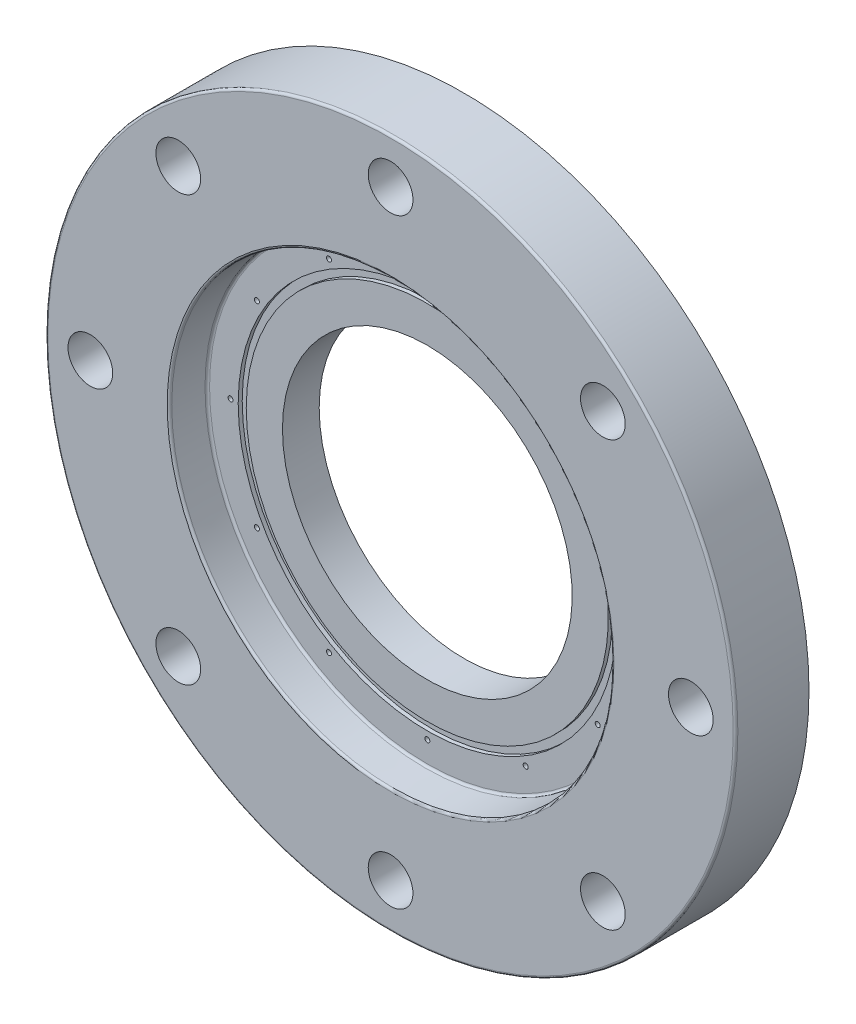
ISO-10303-21;
HEADER;
FILE_DESCRIPTION(('STEP AP214'),'2;1');
FILE_NAME('part.step','',(''),(''),'','','');
FILE_SCHEMA(('AUTOMOTIVE_DESIGN { 1 0 10303 214 1 1 1 1 }'));
ENDSEC;
DATA;
#1=APPLICATION_CONTEXT('core data for automotive mechanical design processes');
#2=APPLICATION_PROTOCOL_DEFINITION('international standard','automotive_design',2000,#1);
#3=PRODUCT_CONTEXT('',#1,'mechanical');
#4=PRODUCT('Part','Part','',(#3));
#5=PRODUCT_RELATED_PRODUCT_CATEGORY('part','',(#4));
#6=PRODUCT_DEFINITION_FORMATION('','',#4);
#7=PRODUCT_DEFINITION_CONTEXT('part definition',#1,'design');
#8=PRODUCT_DEFINITION('design','',#6,#7);
#9=PRODUCT_DEFINITION_SHAPE('','',#8);
#10=(LENGTH_UNIT() NAMED_UNIT(*) SI_UNIT(.MILLI.,.METRE.));
#11=(NAMED_UNIT(*) PLANE_ANGLE_UNIT() SI_UNIT($,.RADIAN.));
#12=(NAMED_UNIT(*) SI_UNIT($,.STERADIAN.) SOLID_ANGLE_UNIT());
#13=UNCERTAINTY_MEASURE_WITH_UNIT(LENGTH_MEASURE(1.E-05),#10,'distance_accuracy_value','');
#14=(GEOMETRIC_REPRESENTATION_CONTEXT(3) GLOBAL_UNCERTAINTY_ASSIGNED_CONTEXT((#13)) GLOBAL_UNIT_ASSIGNED_CONTEXT((#10,
#11,#12)) REPRESENTATION_CONTEXT('',''));
#15=CARTESIAN_POINT('',(0.,0.,0.));
#16=DIRECTION('',(0.,0.,1.));
#17=DIRECTION('',(1.,0.,0.));
#18=AXIS2_PLACEMENT_3D('',#15,#16,#17);
#19=CARTESIAN_POINT('',(0.,109.347,18.25625));
#20=DIRECTION('',(0.,0.,-1.));
#21=DIRECTION('',(0.,1.,0.));
#22=AXIS2_PLACEMENT_3D('',#19,#20,#21);
#23=PLANE('',#22);
#24=CARTESIAN_POINT('',(0.,0.,18.25625));
#25=DIRECTION('',(0.,0.,-1.));
#26=DIRECTION('',(0.,1.,0.));
#27=AXIS2_PLACEMENT_3D('',#24,#25,#26);
#28=CIRCLE('',#27,72.);
#29=CARTESIAN_POINT('',(0.,72.,18.25625));
#30=VERTEX_POINT('',#29);
#31=EDGE_CURVE('E44',#30,#30,#28,.T.);
#32=ORIENTED_EDGE('',*,*,#31,.T.);
#33=EDGE_LOOP('',(#32));
#34=FACE_BOUND('',#33,.T.);
#35=CARTESIAN_POINT('',(0.,0.,18.25625));
#36=DIRECTION('',(0.,0.,-1.));
#37=DIRECTION('',(-1.,0.,0.));
#38=AXIS2_PLACEMENT_3D('',#35,#36,#37);
#39=CIRCLE('',#38,90.);
#40=CARTESIAN_POINT('',(-90.,0.,18.25625));
#41=VERTEX_POINT('',#40);
#42=EDGE_CURVE('E837',#41,#41,#39,.T.);
#43=ORIENTED_EDGE('',*,*,#42,.F.);
#44=EDGE_LOOP('',(#43));
#45=FACE_BOUND('',#44,.T.);
#46=ADVANCED_FACE('F40',(#34,#45),#23,.F.);
#47=CARTESIAN_POINT('',(0.,0.,36.5125));
#48=DIRECTION('',(0.,0.,-1.));
#49=DIRECTION('',(-1.,0.,0.));
#50=AXIS2_PLACEMENT_3D('',#47,#48,#49);
#51=CYLINDRICAL_SURFACE('',#50,171.45);
#52=CARTESIAN_POINT('',(0.,0.,35.3579545454545));
#53=DIRECTION('',(0.,0.,1.));
#54=DIRECTION('',(1.,0.,0.));
#55=AXIS2_PLACEMENT_3D('',#52,#53,#54);
#56=CIRCLE('',#55,171.45);
#57=CARTESIAN_POINT('',(171.45,0.,35.3579545454545));
#58=VERTEX_POINT('',#57);
#59=EDGE_CURVE('E11',#58,#58,#56,.F.);
#60=ORIENTED_EDGE('',*,*,#59,.T.);
#61=EDGE_LOOP('',(#60));
#62=FACE_BOUND('',#61,.T.);
#63=CARTESIAN_POINT('',(0.,0.,0.));
#64=DIRECTION('',(0.,0.,1.));
#65=DIRECTION('',(1.,0.,0.));
#66=AXIS2_PLACEMENT_3D('',#63,#64,#65);
#67=CIRCLE('',#66,171.45);
#68=CARTESIAN_POINT('',(171.45,0.,0.));
#69=VERTEX_POINT('',#68);
#70=EDGE_CURVE('E218',#69,#69,#67,.T.);
#71=ORIENTED_EDGE('',*,*,#70,.T.);
#72=EDGE_LOOP('',(#71));
#73=FACE_BOUND('',#72,.T.);
#74=ADVANCED_FACE('F256',(#62,#73),#51,.T.);
#75=CARTESIAN_POINT('',(0.,0.,36.5125));
#76=DIRECTION('',(0.,0.,1.));
#77=DIRECTION('',(1.,0.,0.));
#78=AXIS2_PLACEMENT_3D('',#75,#76,#77);
#79=PLANE('',#78);
#80=CARTESIAN_POINT('',(0.,0.,36.5125));
#81=DIRECTION('',(0.,0.,1.));
#82=DIRECTION('',(1.,0.,0.));
#83=AXIS2_PLACEMENT_3D('',#80,#81,#82);
#84=CIRCLE('',#83,111.037468728978);
#85=CARTESIAN_POINT('',(111.037468728978,0.,36.5125));
#86=VERTEX_POINT('',#85);
#87=EDGE_CURVE('E49',#86,#86,#84,.F.);
#88=ORIENTED_EDGE('',*,*,#87,.T.);
#89=EDGE_LOOP('',(#88));
#90=FACE_BOUND('',#89,.T.);
#91=CARTESIAN_POINT('',(0.,0.,36.5125));
#92=DIRECTION('',(0.,0.,1.));
#93=DIRECTION('',(1.,0.,0.));
#94=AXIS2_PLACEMENT_3D('',#91,#92,#93);
#95=CIRCLE('',#94,170.295454545455);
#96=CARTESIAN_POINT('',(170.295454545455,0.,36.5125));
#97=VERTEX_POINT('',#96);
#98=EDGE_CURVE('E232',#97,#97,#95,.T.);
#99=ORIENTED_EDGE('',*,*,#98,.T.);
#100=EDGE_LOOP('',(#99));
#101=FACE_BOUND('',#100,.T.);
#102=CARTESIAN_POINT('',(105.518009422561,105.518009422564,36.5125));
#103=DIRECTION('',(0.,0.,1.));
#104=DIRECTION('',(0.707106781186556,-0.707106781186539,0.));
#105=AXIS2_PLACEMENT_3D('',#102,#103,#104);
#106=CIRCLE('',#105,11.1125);
#107=CARTESIAN_POINT('',(113.375733528497,97.6602853166284,36.5125));
#108=VERTEX_POINT('',#107);
#109=EDGE_CURVE('E176',#108,#108,#106,.T.);
#110=ORIENTED_EDGE('',*,*,#109,.F.);
#111=EDGE_LOOP('',(#110));
#112=FACE_BOUND('',#111,.T.);
#113=CARTESIAN_POINT('',(149.225,1.5630489083666E-12,36.5125));
#114=DIRECTION('',(0.,0.,1.));
#115=DIRECTION('',(0.,-1.,0.));
#116=AXIS2_PLACEMENT_3D('',#113,#114,#115);
#117=CIRCLE('',#116,11.1125);
#118=CARTESIAN_POINT('',(149.225,-11.1124999999984,36.5125));
#119=VERTEX_POINT('',#118);
#120=EDGE_CURVE('E175',#119,#119,#117,.T.);
#121=ORIENTED_EDGE('',*,*,#120,.F.);
#122=EDGE_LOOP('',(#121));
#123=FACE_BOUND('',#122,.T.);
#124=CARTESIAN_POINT('',(105.518009422563,-105.518009422562,36.5125));
#125=DIRECTION('',(0.,0.,1.));
#126=DIRECTION('',(-0.707106781186541,-0.707106781186554,0.));
#127=AXIS2_PLACEMENT_3D('',#124,#125,#126);
#128=CIRCLE('',#127,11.1125);
#129=CARTESIAN_POINT('',(97.660285316628,-113.375733528497,36.5125));
#130=VERTEX_POINT('',#129);
#131=EDGE_CURVE('E182',#130,#130,#128,.T.);
#132=ORIENTED_EDGE('',*,*,#131,.F.);
#133=EDGE_LOOP('',(#132));
#134=FACE_BOUND('',#133,.T.);
#135=CARTESIAN_POINT('',(1.04203260557773E-12,-149.225,36.5125));
#136=DIRECTION('',(0.,0.,1.));
#137=DIRECTION('',(-1.,0.,0.));
#138=AXIS2_PLACEMENT_3D('',#135,#136,#137);
#139=CIRCLE('',#138,11.1125);
#140=CARTESIAN_POINT('',(-11.112499999999,-149.225,36.5125));
#141=VERTEX_POINT('',#140);
#142=EDGE_CURVE('E188',#141,#141,#139,.T.);
#143=ORIENTED_EDGE('',*,*,#142,.F.);
#144=EDGE_LOOP('',(#143));
#145=FACE_BOUND('',#144,.T.);
#146=CARTESIAN_POINT('',(-105.518009422562,-105.518009422563,36.5125));
#147=DIRECTION('',(0.,0.,1.));
#148=DIRECTION('',(-0.707106781186551,0.707106781186544,0.));
#149=AXIS2_PLACEMENT_3D('',#146,#147,#148);
#150=CIRCLE('',#149,11.1125);
#151=CARTESIAN_POINT('',(-113.375733528498,-97.6602853166276,36.5125));
#152=VERTEX_POINT('',#151);
#153=EDGE_CURVE('E194',#152,#152,#150,.T.);
#154=ORIENTED_EDGE('',*,*,#153,.F.);
#155=EDGE_LOOP('',(#154));
#156=FACE_BOUND('',#155,.T.);
#157=CARTESIAN_POINT('',(-149.225,-5.21016302788867E-13,36.5125));
#158=DIRECTION('',(0.,0.,1.));
#159=DIRECTION('',(0.,1.,0.));
#160=AXIS2_PLACEMENT_3D('',#157,#158,#159);
#161=CIRCLE('',#160,11.1125);
#162=CARTESIAN_POINT('',(-149.225,11.1124999999995,36.5125));
#163=VERTEX_POINT('',#162);
#164=EDGE_CURVE('E200',#163,#163,#161,.T.);
#165=ORIENTED_EDGE('',*,*,#164,.F.);
#166=EDGE_LOOP('',(#165));
#167=FACE_BOUND('',#166,.T.);
#168=CARTESIAN_POINT('',(-105.518009422563,105.518009422562,36.5125));
#169=DIRECTION('',(0.,0.,1.));
#170=DIRECTION('',(0.707106781186546,0.707106781186549,0.));
#171=AXIS2_PLACEMENT_3D('',#168,#169,#170);
#172=CIRCLE('',#171,11.1125);
#173=CARTESIAN_POINT('',(-97.6602853166273,113.375733528498,36.5125));
#174=VERTEX_POINT('',#173);
#175=EDGE_CURVE('E206',#174,#174,#172,.T.);
#176=ORIENTED_EDGE('',*,*,#175,.F.);
#177=EDGE_LOOP('',(#176));
#178=FACE_BOUND('',#177,.T.);
#179=CARTESIAN_POINT('',(0.,149.225,36.5125));
#180=DIRECTION('',(0.,0.,1.));
#181=DIRECTION('',(1.,0.,0.));
#182=AXIS2_PLACEMENT_3D('',#179,#180,#181);
#183=CIRCLE('',#182,11.1125);
#184=CARTESIAN_POINT('',(11.1125,149.225,36.5125));
#185=VERTEX_POINT('',#184);
#186=EDGE_CURVE('E212',#185,#185,#183,.T.);
#187=ORIENTED_EDGE('',*,*,#186,.F.);
#188=EDGE_LOOP('',(#187));
#189=FACE_BOUND('',#188,.T.);
#190=ADVANCED_FACE('F238',(#90,#101,#112,#123,#134,#145,#156,#167,#178,#189),#79,.T.);
#191=CARTESIAN_POINT('',(0.,0.,0.));
#192=DIRECTION('',(0.,0.,1.));
#193=DIRECTION('',(1.,0.,0.));
#194=AXIS2_PLACEMENT_3D('',#191,#192,#193);
#195=PLANE('',#194);
#196=CARTESIAN_POINT('',(0.,0.,0.));
#197=DIRECTION('',(0.,0.,-1.));
#198=DIRECTION('',(-1.,0.,0.));
#199=AXIS2_PLACEMENT_3D('',#196,#197,#198);
#200=CIRCLE('',#199,72.);
#201=CARTESIAN_POINT('',(-72.,0.,0.));
#202=VERTEX_POINT('',#201);
#203=EDGE_CURVE('E169',#202,#202,#200,.T.);
#204=ORIENTED_EDGE('',*,*,#203,.F.);
#205=EDGE_LOOP('',(#204));
#206=FACE_BOUND('',#205,.T.);
#207=CARTESIAN_POINT('',(105.518009422561,105.518009422564,0.));
#208=DIRECTION('',(0.,0.,1.));
#209=DIRECTION('',(0.707106781186556,-0.707106781186539,0.));
#210=AXIS2_PLACEMENT_3D('',#207,#208,#209);
#211=CIRCLE('',#210,11.1125);
#212=CARTESIAN_POINT('',(113.375733528497,97.6602853166284,0.));
#213=VERTEX_POINT('',#212);
#214=EDGE_CURVE('E172',#213,#213,#211,.T.);
#215=ORIENTED_EDGE('',*,*,#214,.T.);
#216=EDGE_LOOP('',(#215));
#217=FACE_BOUND('',#216,.T.);
#218=CARTESIAN_POINT('',(149.225,1.5630489083666E-12,0.));
#219=DIRECTION('',(0.,0.,1.));
#220=DIRECTION('',(0.,-1.,0.));
#221=AXIS2_PLACEMENT_3D('',#218,#219,#220);
#222=CIRCLE('',#221,11.1125);
#223=CARTESIAN_POINT('',(149.225,-11.1124999999984,0.));
#224=VERTEX_POINT('',#223);
#225=EDGE_CURVE('E179',#224,#224,#222,.T.);
#226=ORIENTED_EDGE('',*,*,#225,.T.);
#227=EDGE_LOOP('',(#226));
#228=FACE_BOUND('',#227,.T.);
#229=CARTESIAN_POINT('',(105.518009422563,-105.518009422562,0.));
#230=DIRECTION('',(0.,0.,1.));
#231=DIRECTION('',(-0.707106781186541,-0.707106781186554,0.));
#232=AXIS2_PLACEMENT_3D('',#229,#230,#231);
#233=CIRCLE('',#232,11.1125);
#234=CARTESIAN_POINT('',(97.660285316628,-113.375733528497,0.));
#235=VERTEX_POINT('',#234);
#236=EDGE_CURVE('E185',#235,#235,#233,.T.);
#237=ORIENTED_EDGE('',*,*,#236,.T.);
#238=EDGE_LOOP('',(#237));
#239=FACE_BOUND('',#238,.T.);
#240=CARTESIAN_POINT('',(1.04203260557773E-12,-149.225,0.));
#241=DIRECTION('',(0.,0.,1.));
#242=DIRECTION('',(-1.,0.,0.));
#243=AXIS2_PLACEMENT_3D('',#240,#241,#242);
#244=CIRCLE('',#243,11.1125);
#245=CARTESIAN_POINT('',(-11.112499999999,-149.225,0.));
#246=VERTEX_POINT('',#245);
#247=EDGE_CURVE('E191',#246,#246,#244,.T.);
#248=ORIENTED_EDGE('',*,*,#247,.T.);
#249=EDGE_LOOP('',(#248));
#250=FACE_BOUND('',#249,.T.);
#251=CARTESIAN_POINT('',(-105.518009422562,-105.518009422563,0.));
#252=DIRECTION('',(0.,0.,1.));
#253=DIRECTION('',(-0.707106781186551,0.707106781186544,0.));
#254=AXIS2_PLACEMENT_3D('',#251,#252,#253);
#255=CIRCLE('',#254,11.1125);
#256=CARTESIAN_POINT('',(-113.375733528498,-97.6602853166276,0.));
#257=VERTEX_POINT('',#256);
#258=EDGE_CURVE('E197',#257,#257,#255,.T.);
#259=ORIENTED_EDGE('',*,*,#258,.T.);
#260=EDGE_LOOP('',(#259));
#261=FACE_BOUND('',#260,.T.);
#262=CARTESIAN_POINT('',(-149.225,-5.21016302788867E-13,0.));
#263=DIRECTION('',(0.,0.,1.));
#264=DIRECTION('',(0.,1.,0.));
#265=AXIS2_PLACEMENT_3D('',#262,#263,#264);
#266=CIRCLE('',#265,11.1125);
#267=CARTESIAN_POINT('',(-149.225,11.1124999999995,0.));
#268=VERTEX_POINT('',#267);
#269=EDGE_CURVE('E203',#268,#268,#266,.T.);
#270=ORIENTED_EDGE('',*,*,#269,.T.);
#271=EDGE_LOOP('',(#270));
#272=FACE_BOUND('',#271,.T.);
#273=CARTESIAN_POINT('',(-105.518009422563,105.518009422562,0.));
#274=DIRECTION('',(0.,0.,1.));
#275=DIRECTION('',(0.707106781186546,0.707106781186549,0.));
#276=AXIS2_PLACEMENT_3D('',#273,#274,#275);
#277=CIRCLE('',#276,11.1125);
#278=CARTESIAN_POINT('',(-97.6602853166273,113.375733528498,0.));
#279=VERTEX_POINT('',#278);
#280=EDGE_CURVE('E209',#279,#279,#277,.T.);
#281=ORIENTED_EDGE('',*,*,#280,.T.);
#282=EDGE_LOOP('',(#281));
#283=FACE_BOUND('',#282,.T.);
#284=CARTESIAN_POINT('',(0.,149.225,0.));
#285=DIRECTION('',(0.,0.,1.));
#286=DIRECTION('',(1.,0.,0.));
#287=AXIS2_PLACEMENT_3D('',#284,#285,#286);
#288=CIRCLE('',#287,11.1125);
#289=CARTESIAN_POINT('',(11.1125,149.225,0.));
#290=VERTEX_POINT('',#289);
#291=EDGE_CURVE('E215',#290,#290,#288,.T.);
#292=ORIENTED_EDGE('',*,*,#291,.T.);
#293=EDGE_LOOP('',(#292));
#294=FACE_BOUND('',#293,.T.);
#295=ORIENTED_EDGE('',*,*,#70,.F.);
#296=EDGE_LOOP('',(#295));
#297=FACE_BOUND('',#296,.T.);
#298=ADVANCED_FACE('F336',(#206,#217,#228,#239,#250,#261,#272,#283,#294,#297),#195,.F.);
#299=CARTESIAN_POINT('',(0.,149.225,0.));
#300=DIRECTION('',(0.,0.,1.));
#301=DIRECTION('',(1.,0.,0.));
#302=AXIS2_PLACEMENT_3D('',#299,#300,#301);
#303=CYLINDRICAL_SURFACE('',#302,11.1125);
#304=ORIENTED_EDGE('',*,*,#291,.F.);
#305=EDGE_LOOP('',(#304));
#306=FACE_BOUND('',#305,.T.);
#307=ORIENTED_EDGE('',*,*,#186,.T.);
#308=EDGE_LOOP('',(#307));
#309=FACE_BOUND('',#308,.T.);
#310=ADVANCED_FACE('F339',(#306,#309),#303,.F.);
#311=CARTESIAN_POINT('',(-105.518009422563,105.518009422562,0.));
#312=DIRECTION('',(0.,0.,1.));
#313=DIRECTION('',(1.,0.,0.));
#314=AXIS2_PLACEMENT_3D('',#311,#312,#313);
#315=CYLINDRICAL_SURFACE('',#314,11.1125);
#316=ORIENTED_EDGE('',*,*,#280,.F.);
#317=EDGE_LOOP('',(#316));
#318=FACE_BOUND('',#317,.T.);
#319=ORIENTED_EDGE('',*,*,#175,.T.);
#320=EDGE_LOOP('',(#319));
#321=FACE_BOUND('',#320,.T.);
#322=ADVANCED_FACE('F362',(#318,#321),#315,.F.);
#323=CARTESIAN_POINT('',(-149.225,-5.21016302788867E-13,0.));
#324=DIRECTION('',(0.,0.,1.));
#325=DIRECTION('',(1.,0.,0.));
#326=AXIS2_PLACEMENT_3D('',#323,#324,#325);
#327=CYLINDRICAL_SURFACE('',#326,11.1125);
#328=ORIENTED_EDGE('',*,*,#269,.F.);
#329=EDGE_LOOP('',(#328));
#330=FACE_BOUND('',#329,.T.);
#331=ORIENTED_EDGE('',*,*,#164,.T.);
#332=EDGE_LOOP('',(#331));
#333=FACE_BOUND('',#332,.T.);
#334=ADVANCED_FACE('F373',(#330,#333),#327,.F.);
#335=CARTESIAN_POINT('',(-105.518009422562,-105.518009422563,0.));
#336=DIRECTION('',(0.,0.,1.));
#337=DIRECTION('',(1.,0.,0.));
#338=AXIS2_PLACEMENT_3D('',#335,#336,#337);
#339=CYLINDRICAL_SURFACE('',#338,11.1125);
#340=ORIENTED_EDGE('',*,*,#258,.F.);
#341=EDGE_LOOP('',(#340));
#342=FACE_BOUND('',#341,.T.);
#343=ORIENTED_EDGE('',*,*,#153,.T.);
#344=EDGE_LOOP('',(#343));
#345=FACE_BOUND('',#344,.T.);
#346=ADVANCED_FACE('F377',(#342,#345),#339,.F.);
#347=CARTESIAN_POINT('',(1.04203260557773E-12,-149.225,0.));
#348=DIRECTION('',(0.,0.,1.));
#349=DIRECTION('',(1.,0.,0.));
#350=AXIS2_PLACEMENT_3D('',#347,#348,#349);
#351=CYLINDRICAL_SURFACE('',#350,11.1125);
#352=ORIENTED_EDGE('',*,*,#247,.F.);
#353=EDGE_LOOP('',(#352));
#354=FACE_BOUND('',#353,.T.);
#355=ORIENTED_EDGE('',*,*,#142,.T.);
#356=EDGE_LOOP('',(#355));
#357=FACE_BOUND('',#356,.T.);
#358=ADVANCED_FACE('F381',(#354,#357),#351,.F.);
#359=CARTESIAN_POINT('',(105.518009422563,-105.518009422562,0.));
#360=DIRECTION('',(0.,0.,1.));
#361=DIRECTION('',(1.,0.,0.));
#362=AXIS2_PLACEMENT_3D('',#359,#360,#361);
#363=CYLINDRICAL_SURFACE('',#362,11.1125);
#364=ORIENTED_EDGE('',*,*,#236,.F.);
#365=EDGE_LOOP('',(#364));
#366=FACE_BOUND('',#365,.T.);
#367=ORIENTED_EDGE('',*,*,#131,.T.);
#368=EDGE_LOOP('',(#367));
#369=FACE_BOUND('',#368,.T.);
#370=ADVANCED_FACE('F385',(#366,#369),#363,.F.);
#371=CARTESIAN_POINT('',(149.225,1.5630489083666E-12,0.));
#372=DIRECTION('',(0.,0.,1.));
#373=DIRECTION('',(1.,0.,0.));
#374=AXIS2_PLACEMENT_3D('',#371,#372,#373);
#375=CYLINDRICAL_SURFACE('',#374,11.1125);
#376=ORIENTED_EDGE('',*,*,#225,.F.);
#377=EDGE_LOOP('',(#376));
#378=FACE_BOUND('',#377,.T.);
#379=ORIENTED_EDGE('',*,*,#120,.T.);
#380=EDGE_LOOP('',(#379));
#381=FACE_BOUND('',#380,.T.);
#382=ADVANCED_FACE('F277',(#378,#381),#375,.F.);
#383=CARTESIAN_POINT('',(105.518009422561,105.518009422564,0.));
#384=DIRECTION('',(0.,0.,1.));
#385=DIRECTION('',(1.,0.,0.));
#386=AXIS2_PLACEMENT_3D('',#383,#384,#385);
#387=CYLINDRICAL_SURFACE('',#386,11.1125);
#388=ORIENTED_EDGE('',*,*,#214,.F.);
#389=EDGE_LOOP('',(#388));
#390=FACE_BOUND('',#389,.T.);
#391=ORIENTED_EDGE('',*,*,#109,.T.);
#392=EDGE_LOOP('',(#391));
#393=FACE_BOUND('',#392,.T.);
#394=ADVANCED_FACE('F270',(#390,#393),#387,.F.);
#395=CARTESIAN_POINT('',(0.,0.,18.25625));
#396=DIRECTION('',(0.,0.,-1.));
#397=DIRECTION('',(-1.,0.,0.));
#398=AXIS2_PLACEMENT_3D('',#395,#396,#397);
#399=CIRCLE('',#398,94.);
#400=CARTESIAN_POINT('',(-94.,0.,18.25625));
#401=VERTEX_POINT('',#400);
#402=EDGE_CURVE('E282',#401,#401,#399,.T.);
#403=ORIENTED_EDGE('',*,*,#402,.T.);
#404=EDGE_LOOP('',(#403));
#405=FACE_BOUND('',#404,.T.);
#406=CARTESIAN_POINT('',(-48.8950000000067,84.6886242360764,18.25625));
#407=DIRECTION('',(0.,0.,1.));
#408=DIRECTION('',(1.,0.,0.));
#409=AXIS2_PLACEMENT_3D('',#406,#407,#408);
#410=CIRCLE('',#409,1.24999999999999);
#411=CARTESIAN_POINT('',(-47.6450000000067,84.6886242360764,18.25625));
#412=VERTEX_POINT('',#411);
#413=EDGE_CURVE('E97',#412,#412,#410,.T.);
#414=ORIENTED_EDGE('',*,*,#413,.F.);
#415=EDGE_LOOP('',(#414));
#416=FACE_BOUND('',#415,.T.);
#417=CARTESIAN_POINT('',(-84.6886242360838,48.8949999999939,18.25625));
#418=DIRECTION('',(0.,0.,1.));
#419=DIRECTION('',(1.,0.,0.));
#420=AXIS2_PLACEMENT_3D('',#417,#418,#419);
#421=CIRCLE('',#420,1.24999999999999);
#422=CARTESIAN_POINT('',(-83.4386242360838,48.8949999999939,18.25625));
#423=VERTEX_POINT('',#422);
#424=EDGE_CURVE('E96',#423,#423,#421,.T.);
#425=ORIENTED_EDGE('',*,*,#424,.F.);
#426=EDGE_LOOP('',(#425));
#427=FACE_BOUND('',#426,.T.);
#428=CARTESIAN_POINT('',(-97.79,-6.27152140327151E-12,18.25625));
#429=DIRECTION('',(0.,0.,1.));
#430=DIRECTION('',(1.,0.,0.));
#431=AXIS2_PLACEMENT_3D('',#428,#429,#430);
#432=CIRCLE('',#431,1.24999999999999);
#433=CARTESIAN_POINT('',(-96.54,-6.27152140327151E-12,18.25625));
#434=VERTEX_POINT('',#433);
#435=EDGE_CURVE('E109',#434,#434,#432,.T.);
#436=ORIENTED_EDGE('',*,*,#435,.F.);
#437=EDGE_LOOP('',(#436));
#438=FACE_BOUND('',#437,.T.);
#439=CARTESIAN_POINT('',(-84.6886242360775,-48.8950000000049,18.25625));
#440=DIRECTION('',(0.,0.,1.));
#441=DIRECTION('',(1.,0.,0.));
#442=AXIS2_PLACEMENT_3D('',#439,#440,#441);
#443=CIRCLE('',#442,1.24999999999999);
#444=CARTESIAN_POINT('',(-83.4386242360775,-48.8950000000049,18.25625));
#445=VERTEX_POINT('',#444);
#446=EDGE_CURVE('E115',#445,#445,#443,.T.);
#447=ORIENTED_EDGE('',*,*,#446,.F.);
#448=EDGE_LOOP('',(#447));
#449=FACE_BOUND('',#448,.T.);
#450=CARTESIAN_POINT('',(-48.8949999999958,-84.6886242360827,18.25625));
#451=DIRECTION('',(0.,0.,1.));
#452=DIRECTION('',(1.,0.,0.));
#453=AXIS2_PLACEMENT_3D('',#450,#451,#452);
#454=CIRCLE('',#453,1.24999999999999);
#455=CARTESIAN_POINT('',(-47.6449999999958,-84.6886242360827,18.25625));
#456=VERTEX_POINT('',#455);
#457=EDGE_CURVE('E121',#456,#456,#454,.T.);
#458=ORIENTED_EDGE('',*,*,#457,.F.);
#459=EDGE_LOOP('',(#458));
#460=FACE_BOUND('',#459,.T.);
#461=CARTESIAN_POINT('',(4.18101426884767E-12,-97.79,18.25625));
#462=DIRECTION('',(0.,0.,1.));
#463=DIRECTION('',(1.,0.,0.));
#464=AXIS2_PLACEMENT_3D('',#461,#462,#463);
#465=CIRCLE('',#464,1.24999999999999);
#466=CARTESIAN_POINT('',(1.25000000000417,-97.79,18.25625));
#467=VERTEX_POINT('',#466);
#468=EDGE_CURVE('E127',#467,#467,#465,.T.);
#469=ORIENTED_EDGE('',*,*,#468,.F.);
#470=EDGE_LOOP('',(#469));
#471=FACE_BOUND('',#470,.T.);
#472=CARTESIAN_POINT('',(48.895000000003,-84.6886242360785,18.25625));
#473=DIRECTION('',(0.,0.,1.));
#474=DIRECTION('',(1.,0.,0.));
#475=AXIS2_PLACEMENT_3D('',#472,#473,#474);
#476=CIRCLE('',#475,1.24999999999999);
#477=CARTESIAN_POINT('',(50.145000000003,-84.6886242360785,18.25625));
#478=VERTEX_POINT('',#477);
#479=EDGE_CURVE('E133',#478,#478,#476,.T.);
#480=ORIENTED_EDGE('',*,*,#479,.F.);
#481=EDGE_LOOP('',(#480));
#482=FACE_BOUND('',#481,.T.);
#483=CARTESIAN_POINT('',(84.6886242360817,-48.8949999999976,18.25625));
#484=DIRECTION('',(0.,0.,1.));
#485=DIRECTION('',(1.,0.,0.));
#486=AXIS2_PLACEMENT_3D('',#483,#484,#485);
#487=CIRCLE('',#486,1.24999999999999);
#488=CARTESIAN_POINT('',(85.9386242360817,-48.8949999999976,18.25625));
#489=VERTEX_POINT('',#488);
#490=EDGE_CURVE('E139',#489,#489,#487,.T.);
#491=ORIENTED_EDGE('',*,*,#490,.F.);
#492=EDGE_LOOP('',(#491));
#493=FACE_BOUND('',#492,.T.);
#494=CARTESIAN_POINT('',(97.79,2.09050713442384E-12,18.25625));
#495=DIRECTION('',(0.,0.,1.));
#496=DIRECTION('',(1.,0.,0.));
#497=AXIS2_PLACEMENT_3D('',#494,#495,#496);
#498=CIRCLE('',#497,1.24999999999999);
#499=CARTESIAN_POINT('',(99.04,2.09050713442384E-12,18.25625));
#500=VERTEX_POINT('',#499);
#501=EDGE_CURVE('E145',#500,#500,#498,.T.);
#502=ORIENTED_EDGE('',*,*,#501,.F.);
#503=EDGE_LOOP('',(#502));
#504=FACE_BOUND('',#503,.T.);
#505=CARTESIAN_POINT('',(84.6886242360796,48.8950000000012,18.25625));
#506=DIRECTION('',(0.,0.,1.));
#507=DIRECTION('',(1.,0.,0.));
#508=AXIS2_PLACEMENT_3D('',#505,#506,#507);
#509=CIRCLE('',#508,1.24999999999999);
#510=CARTESIAN_POINT('',(85.9386242360795,48.8950000000012,18.25625));
#511=VERTEX_POINT('',#510);
#512=EDGE_CURVE('E151',#511,#511,#509,.T.);
#513=ORIENTED_EDGE('',*,*,#512,.F.);
#514=EDGE_LOOP('',(#513));
#515=FACE_BOUND('',#514,.T.);
#516=CARTESIAN_POINT('',(48.8949999999994,84.6886242360806,18.25625));
#517=DIRECTION('',(0.,0.,1.));
#518=DIRECTION('',(1.,0.,0.));
#519=AXIS2_PLACEMENT_3D('',#516,#517,#518);
#520=CIRCLE('',#519,1.24999999999999);
#521=CARTESIAN_POINT('',(50.1449999999994,84.6886242360806,18.25625));
#522=VERTEX_POINT('',#521);
#523=EDGE_CURVE('E157',#522,#522,#520,.T.);
#524=ORIENTED_EDGE('',*,*,#523,.F.);
#525=EDGE_LOOP('',(#524));
#526=FACE_BOUND('',#525,.T.);
#527=CARTESIAN_POINT('',(0.,97.79,18.25625));
#528=DIRECTION('',(0.,0.,1.));
#529=DIRECTION('',(1.,0.,0.));
#530=AXIS2_PLACEMENT_3D('',#527,#528,#529);
#531=CIRCLE('',#530,1.24999999999999);
#532=CARTESIAN_POINT('',(1.24999999999999,97.79,18.25625));
#533=VERTEX_POINT('',#532);
#534=EDGE_CURVE('E163',#533,#533,#531,.T.);
#535=ORIENTED_EDGE('',*,*,#534,.F.);
#536=EDGE_LOOP('',(#535));
#537=FACE_BOUND('',#536,.T.);
#538=CARTESIAN_POINT('',(0.,0.,18.25625));
#539=DIRECTION('',(0.,0.,-1.));
#540=DIRECTION('',(0.,1.,0.));
#541=AXIS2_PLACEMENT_3D('',#538,#539,#540);
#542=CIRCLE('',#541,108.228031271022);
#543=CARTESIAN_POINT('',(0.,108.228031271022,18.25625));
#544=VERTEX_POINT('',#543);
#545=EDGE_CURVE('E229',#544,#544,#542,.F.);
#546=ORIENTED_EDGE('',*,*,#545,.T.);
#547=EDGE_LOOP('',(#546));
#548=FACE_BOUND('',#547,.T.);
#549=ADVANCED_FACE('F259',(#405,#416,#427,#438,#449,#460,#471,#482,#493,#504,#515,#526,#537,
#548),#23,.F.);
#550=CARTESIAN_POINT('',(0.,0.,18.25625));
#551=DIRECTION('',(0.,0.,1.));
#552=DIRECTION('',(0.,-1.,0.));
#553=AXIS2_PLACEMENT_3D('',#550,#551,#552);
#554=CONICAL_SURFACE('',#553,109.347,0.0312941281419109);
#555=CARTESIAN_POINT('',(0.,0.,19.3746708580904));
#556=DIRECTION('',(0.,0.,1.));
#557=DIRECTION('',(0.,-1.,0.));
#558=AXIS2_PLACEMENT_3D('',#555,#556,#557);
#559=CIRCLE('',#558,109.382011435558);
#560=CARTESIAN_POINT('',(0.,-109.382011435558,19.3746708580904));
#561=VERTEX_POINT('',#560);
#562=EDGE_CURVE('E226',#561,#561,#559,.F.);
#563=ORIENTED_EDGE('',*,*,#562,.T.);
#564=EDGE_LOOP('',(#563));
#565=FACE_BOUND('',#564,.T.);
#566=CARTESIAN_POINT('',(0.,0.,35.3940791419096));
#567=DIRECTION('',(0.,0.,1.));
#568=DIRECTION('',(0.,-1.,0.));
#569=AXIS2_PLACEMENT_3D('',#566,#567,#568);
#570=CIRCLE('',#569,109.883488564442);
#571=CARTESIAN_POINT('',(0.,-109.883488564442,35.3940791419096));
#572=VERTEX_POINT('',#571);
#573=EDGE_CURVE('E223',#572,#572,#570,.T.);
#574=ORIENTED_EDGE('',*,*,#573,.T.);
#575=EDGE_LOOP('',(#574));
#576=FACE_BOUND('',#575,.T.);
#577=ADVANCED_FACE('F251',(#565,#576),#554,.F.);
#578=CARTESIAN_POINT('',(0.,0.,19.4107954545455));
#579=DIRECTION('',(0.,0.,-1.));
#580=DIRECTION('',(0.,1.,0.));
#581=AXIS2_PLACEMENT_3D('',#578,#579,#580);
#582=TOROIDAL_SURFACE('',#581,108.228031271022,1.15454545454545);
#583=ORIENTED_EDGE('',*,*,#545,.F.);
#584=EDGE_LOOP('',(#583));
#585=FACE_BOUND('',#584,.T.);
#586=ORIENTED_EDGE('',*,*,#562,.F.);
#587=EDGE_LOOP('',(#586));
#588=FACE_BOUND('',#587,.T.);
#589=ADVANCED_FACE('F243',(#585,#588),#582,.F.);
#590=CARTESIAN_POINT('',(0.,0.,35.3579545454545));
#591=DIRECTION('',(0.,0.,1.));
#592=DIRECTION('',(1.,0.,0.));
#593=AXIS2_PLACEMENT_3D('',#590,#591,#592);
#594=TOROIDAL_SURFACE('',#593,111.037468728978,1.15454545454545);
#595=ORIENTED_EDGE('',*,*,#573,.F.);
#596=EDGE_LOOP('',(#595));
#597=FACE_BOUND('',#596,.T.);
#598=ORIENTED_EDGE('',*,*,#87,.F.);
#599=EDGE_LOOP('',(#598));
#600=FACE_BOUND('',#599,.T.);
#601=ADVANCED_FACE('F241',(#597,#600),#594,.T.);
#602=CARTESIAN_POINT('',(0.,0.,35.3579545454545));
#603=DIRECTION('',(0.,0.,1.));
#604=DIRECTION('',(1.,0.,0.));
#605=AXIS2_PLACEMENT_3D('',#602,#603,#604);
#606=TOROIDAL_SURFACE('',#605,170.295454545455,1.15454545454545);
#607=ORIENTED_EDGE('',*,*,#59,.F.);
#608=EDGE_LOOP('',(#607));
#609=FACE_BOUND('',#608,.T.);
#610=ORIENTED_EDGE('',*,*,#98,.F.);
#611=EDGE_LOOP('',(#610));
#612=FACE_BOUND('',#611,.T.);
#613=ADVANCED_FACE('F42',(#609,#612),#606,.T.);
#614=CARTESIAN_POINT('',(0.,0.,120.));
#615=DIRECTION('',(0.,0.,-1.));
#616=DIRECTION('',(-1.,0.,0.));
#617=AXIS2_PLACEMENT_3D('',#614,#615,#616);
#618=CYLINDRICAL_SURFACE('',#617,72.);
#619=ORIENTED_EDGE('',*,*,#203,.T.);
#620=EDGE_LOOP('',(#619));
#621=FACE_BOUND('',#620,.T.);
#622=ORIENTED_EDGE('',*,*,#31,.F.);
#623=EDGE_LOOP('',(#622));
#624=FACE_BOUND('',#623,.T.);
#625=ADVANCED_FACE('F249',(#621,#624),#618,.F.);
#626=CARTESIAN_POINT('',(0.,97.79,6.25625));
#627=DIRECTION('',(0.,0.,1.));
#628=DIRECTION('',(1.,0.,0.));
#629=AXIS2_PLACEMENT_3D('',#626,#627,#628);
#630=CONICAL_SURFACE('',#629,1.25,1.02974425867665);
#631=CARTESIAN_POINT('',(0.,97.79,5.50517422621555));
#632=VERTEX_POINT('',#631);
#633=VERTEX_LOOP('',#632);
#634=FACE_BOUND('',#633,.T.);
#635=CARTESIAN_POINT('',(0.,97.79,6.25625));
#636=DIRECTION('',(0.,0.,1.));
#637=DIRECTION('',(1.,0.,0.));
#638=AXIS2_PLACEMENT_3D('',#635,#636,#637);
#639=CIRCLE('',#638,1.25);
#640=CARTESIAN_POINT('',(1.25,97.79,6.25625));
#641=VERTEX_POINT('',#640);
#642=EDGE_CURVE('E166',#641,#641,#639,.T.);
#643=ORIENTED_EDGE('',*,*,#642,.T.);
#644=EDGE_LOOP('',(#643));
#645=FACE_BOUND('',#644,.T.);
#646=ADVANCED_FACE('F315',(#634,#645),#630,.F.);
#647=CARTESIAN_POINT('',(0.,97.79,18.25625));
#648=DIRECTION('',(0.,0.,1.));
#649=DIRECTION('',(1.,0.,0.));
#650=AXIS2_PLACEMENT_3D('',#647,#648,#649);
#651=CYLINDRICAL_SURFACE('',#650,1.24999999999999);
#652=ORIENTED_EDGE('',*,*,#642,.F.);
#653=EDGE_LOOP('',(#652));
#654=FACE_BOUND('',#653,.T.);
#655=ORIENTED_EDGE('',*,*,#534,.T.);
#656=EDGE_LOOP('',(#655));
#657=FACE_BOUND('',#656,.T.);
#658=ADVANCED_FACE('F312',(#654,#657),#651,.F.);
#659=CARTESIAN_POINT('',(48.8949999999994,84.6886242360806,6.25625));
#660=DIRECTION('',(0.,0.,1.));
#661=DIRECTION('',(1.,0.,0.));
#662=AXIS2_PLACEMENT_3D('',#659,#660,#661);
#663=CONICAL_SURFACE('',#662,1.24999999999999,1.02974425867665);
#664=CARTESIAN_POINT('',(48.8949999999994,84.6886242360806,5.50517422621555));
#665=VERTEX_POINT('',#664);
#666=VERTEX_LOOP('',#665);
#667=FACE_BOUND('',#666,.T.);
#668=CARTESIAN_POINT('',(48.8949999999994,84.6886242360806,6.25625));
#669=DIRECTION('',(0.,0.,1.));
#670=DIRECTION('',(1.,0.,0.));
#671=AXIS2_PLACEMENT_3D('',#668,#669,#670);
#672=CIRCLE('',#671,1.24999999999999);
#673=CARTESIAN_POINT('',(50.1449999999994,84.6886242360806,6.25625));
#674=VERTEX_POINT('',#673);
#675=EDGE_CURVE('E160',#674,#674,#672,.T.);
#676=ORIENTED_EDGE('',*,*,#675,.T.);
#677=EDGE_LOOP('',(#676));
#678=FACE_BOUND('',#677,.T.);
#679=ADVANCED_FACE('F314',(#667,#678),#663,.F.);
#680=CARTESIAN_POINT('',(48.8949999999994,84.6886242360806,18.25625));
#681=DIRECTION('',(0.,0.,1.));
#682=DIRECTION('',(1.,0.,0.));
#683=AXIS2_PLACEMENT_3D('',#680,#681,#682);
#684=CYLINDRICAL_SURFACE('',#683,1.24999999999999);
#685=ORIENTED_EDGE('',*,*,#675,.F.);
#686=EDGE_LOOP('',(#685));
#687=FACE_BOUND('',#686,.T.);
#688=ORIENTED_EDGE('',*,*,#523,.T.);
#689=EDGE_LOOP('',(#688));
#690=FACE_BOUND('',#689,.T.);
#691=ADVANCED_FACE('F322',(#687,#690),#684,.F.);
#692=CARTESIAN_POINT('',(84.6886242360796,48.8950000000012,6.25625));
#693=DIRECTION('',(0.,0.,1.));
#694=DIRECTION('',(1.,0.,0.));
#695=AXIS2_PLACEMENT_3D('',#692,#693,#694);
#696=CONICAL_SURFACE('',#695,1.25,1.02974425867665);
#697=CARTESIAN_POINT('',(84.6886242360796,48.8950000000012,5.50517422621555));
#698=VERTEX_POINT('',#697);
#699=VERTEX_LOOP('',#698);
#700=FACE_BOUND('',#699,.T.);
#701=CARTESIAN_POINT('',(84.6886242360796,48.8950000000012,6.25625));
#702=DIRECTION('',(0.,0.,1.));
#703=DIRECTION('',(1.,0.,0.));
#704=AXIS2_PLACEMENT_3D('',#701,#702,#703);
#705=CIRCLE('',#704,1.25);
#706=CARTESIAN_POINT('',(85.9386242360796,48.8950000000012,6.25625));
#707=VERTEX_POINT('',#706);
#708=EDGE_CURVE('E154',#707,#707,#705,.T.);
#709=ORIENTED_EDGE('',*,*,#708,.T.);
#710=EDGE_LOOP('',(#709));
#711=FACE_BOUND('',#710,.T.);
#712=ADVANCED_FACE('F553',(#700,#711),#696,.F.);
#713=CARTESIAN_POINT('',(84.6886242360796,48.8950000000012,18.25625));
#714=DIRECTION('',(0.,0.,1.));
#715=DIRECTION('',(1.,0.,0.));
#716=AXIS2_PLACEMENT_3D('',#713,#714,#715);
#717=CYLINDRICAL_SURFACE('',#716,1.24999999999999);
#718=ORIENTED_EDGE('',*,*,#708,.F.);
#719=EDGE_LOOP('',(#718));
#720=FACE_BOUND('',#719,.T.);
#721=ORIENTED_EDGE('',*,*,#512,.T.);
#722=EDGE_LOOP('',(#721));
#723=FACE_BOUND('',#722,.T.);
#724=ADVANCED_FACE('F548',(#720,#723),#717,.F.);
#725=CARTESIAN_POINT('',(97.79,2.09050713442384E-12,6.25625));
#726=DIRECTION('',(0.,0.,1.));
#727=DIRECTION('',(1.,0.,0.));
#728=AXIS2_PLACEMENT_3D('',#725,#726,#727);
#729=CONICAL_SURFACE('',#728,1.25,1.02974425867665);
#730=CARTESIAN_POINT('',(97.79,2.09050713442384E-12,5.50517422621555));
#731=VERTEX_POINT('',#730);
#732=VERTEX_LOOP('',#731);
#733=FACE_BOUND('',#732,.T.);
#734=CARTESIAN_POINT('',(97.79,2.09050713442384E-12,6.25625));
#735=DIRECTION('',(0.,0.,1.));
#736=DIRECTION('',(1.,0.,0.));
#737=AXIS2_PLACEMENT_3D('',#734,#735,#736);
#738=CIRCLE('',#737,1.25);
#739=CARTESIAN_POINT('',(99.04,2.09050713442384E-12,6.25625));
#740=VERTEX_POINT('',#739);
#741=EDGE_CURVE('E148',#740,#740,#738,.T.);
#742=ORIENTED_EDGE('',*,*,#741,.T.);
#743=EDGE_LOOP('',(#742));
#744=FACE_BOUND('',#743,.T.);
#745=ADVANCED_FACE('F541',(#733,#744),#729,.F.);
#746=CARTESIAN_POINT('',(97.79,2.09050713442384E-12,18.25625));
#747=DIRECTION('',(0.,0.,1.));
#748=DIRECTION('',(1.,0.,0.));
#749=AXIS2_PLACEMENT_3D('',#746,#747,#748);
#750=CYLINDRICAL_SURFACE('',#749,1.24999999999999);
#751=ORIENTED_EDGE('',*,*,#741,.F.);
#752=EDGE_LOOP('',(#751));
#753=FACE_BOUND('',#752,.T.);
#754=ORIENTED_EDGE('',*,*,#501,.T.);
#755=EDGE_LOOP('',(#754));
#756=FACE_BOUND('',#755,.T.);
#757=ADVANCED_FACE('F536',(#753,#756),#750,.F.);
#758=CARTESIAN_POINT('',(84.6886242360817,-48.8949999999976,6.25625));
#759=DIRECTION('',(0.,0.,1.));
#760=DIRECTION('',(1.,0.,0.));
#761=AXIS2_PLACEMENT_3D('',#758,#759,#760);
#762=CONICAL_SURFACE('',#761,1.25,1.02974425867665);
#763=CARTESIAN_POINT('',(84.6886242360817,-48.8949999999976,5.50517422621555));
#764=VERTEX_POINT('',#763);
#765=VERTEX_LOOP('',#764);
#766=FACE_BOUND('',#765,.T.);
#767=CARTESIAN_POINT('',(84.6886242360817,-48.8949999999976,6.25625));
#768=DIRECTION('',(0.,0.,1.));
#769=DIRECTION('',(1.,0.,0.));
#770=AXIS2_PLACEMENT_3D('',#767,#768,#769);
#771=CIRCLE('',#770,1.25);
#772=CARTESIAN_POINT('',(85.9386242360817,-48.8949999999976,6.25625));
#773=VERTEX_POINT('',#772);
#774=EDGE_CURVE('E142',#773,#773,#771,.T.);
#775=ORIENTED_EDGE('',*,*,#774,.T.);
#776=EDGE_LOOP('',(#775));
#777=FACE_BOUND('',#776,.T.);
#778=ADVANCED_FACE('F529',(#766,#777),#762,.F.);
#779=CARTESIAN_POINT('',(84.6886242360817,-48.8949999999976,18.25625));
#780=DIRECTION('',(0.,0.,1.));
#781=DIRECTION('',(1.,0.,0.));
#782=AXIS2_PLACEMENT_3D('',#779,#780,#781);
#783=CYLINDRICAL_SURFACE('',#782,1.24999999999999);
#784=ORIENTED_EDGE('',*,*,#774,.F.);
#785=EDGE_LOOP('',(#784));
#786=FACE_BOUND('',#785,.T.);
#787=ORIENTED_EDGE('',*,*,#490,.T.);
#788=EDGE_LOOP('',(#787));
#789=FACE_BOUND('',#788,.T.);
#790=ADVANCED_FACE('F524',(#786,#789),#783,.F.);
#791=CARTESIAN_POINT('',(48.895000000003,-84.6886242360785,6.25625));
#792=DIRECTION('',(0.,0.,1.));
#793=DIRECTION('',(1.,0.,0.));
#794=AXIS2_PLACEMENT_3D('',#791,#792,#793);
#795=CONICAL_SURFACE('',#794,1.24999999999999,1.02974425867665);
#796=CARTESIAN_POINT('',(48.895000000003,-84.6886242360785,5.50517422621555));
#797=VERTEX_POINT('',#796);
#798=VERTEX_LOOP('',#797);
#799=FACE_BOUND('',#798,.T.);
#800=CARTESIAN_POINT('',(48.895000000003,-84.6886242360785,6.25625));
#801=DIRECTION('',(0.,0.,1.));
#802=DIRECTION('',(1.,0.,0.));
#803=AXIS2_PLACEMENT_3D('',#800,#801,#802);
#804=CIRCLE('',#803,1.24999999999999);
#805=CARTESIAN_POINT('',(50.145000000003,-84.6886242360785,6.25625));
#806=VERTEX_POINT('',#805);
#807=EDGE_CURVE('E136',#806,#806,#804,.T.);
#808=ORIENTED_EDGE('',*,*,#807,.T.);
#809=EDGE_LOOP('',(#808));
#810=FACE_BOUND('',#809,.T.);
#811=ADVANCED_FACE('F517',(#799,#810),#795,.F.);
#812=CARTESIAN_POINT('',(48.895000000003,-84.6886242360785,18.25625));
#813=DIRECTION('',(0.,0.,1.));
#814=DIRECTION('',(1.,0.,0.));
#815=AXIS2_PLACEMENT_3D('',#812,#813,#814);
#816=CYLINDRICAL_SURFACE('',#815,1.24999999999999);
#817=ORIENTED_EDGE('',*,*,#807,.F.);
#818=EDGE_LOOP('',(#817));
#819=FACE_BOUND('',#818,.T.);
#820=ORIENTED_EDGE('',*,*,#479,.T.);
#821=EDGE_LOOP('',(#820));
#822=FACE_BOUND('',#821,.T.);
#823=ADVANCED_FACE('F512',(#819,#822),#816,.F.);
#824=CARTESIAN_POINT('',(4.18101426884767E-12,-97.79,6.25625));
#825=DIRECTION('',(0.,0.,1.));
#826=DIRECTION('',(1.,0.,0.));
#827=AXIS2_PLACEMENT_3D('',#824,#825,#826);
#828=CONICAL_SURFACE('',#827,1.25,1.02974425867665);
#829=CARTESIAN_POINT('',(4.17789115602126E-12,-97.79,5.50517422621555));
#830=VERTEX_POINT('',#829);
#831=VERTEX_LOOP('',#830);
#832=FACE_BOUND('',#831,.T.);
#833=CARTESIAN_POINT('',(4.18101426884767E-12,-97.79,6.25625));
#834=DIRECTION('',(0.,0.,1.));
#835=DIRECTION('',(1.,0.,0.));
#836=AXIS2_PLACEMENT_3D('',#833,#834,#835);
#837=CIRCLE('',#836,1.25);
#838=CARTESIAN_POINT('',(1.25000000000418,-97.79,6.25625));
#839=VERTEX_POINT('',#838);
#840=EDGE_CURVE('E130',#839,#839,#837,.T.);
#841=ORIENTED_EDGE('',*,*,#840,.T.);
#842=EDGE_LOOP('',(#841));
#843=FACE_BOUND('',#842,.T.);
#844=ADVANCED_FACE('F505',(#832,#843),#828,.F.);
#845=CARTESIAN_POINT('',(4.18101426884767E-12,-97.79,18.25625));
#846=DIRECTION('',(0.,0.,1.));
#847=DIRECTION('',(1.,0.,0.));
#848=AXIS2_PLACEMENT_3D('',#845,#846,#847);
#849=CYLINDRICAL_SURFACE('',#848,1.24999999999999);
#850=ORIENTED_EDGE('',*,*,#840,.F.);
#851=EDGE_LOOP('',(#850));
#852=FACE_BOUND('',#851,.T.);
#853=ORIENTED_EDGE('',*,*,#468,.T.);
#854=EDGE_LOOP('',(#853));
#855=FACE_BOUND('',#854,.T.);
#856=ADVANCED_FACE('F500',(#852,#855),#849,.F.);
#857=CARTESIAN_POINT('',(-48.8949999999958,-84.6886242360827,6.25625));
#858=DIRECTION('',(0.,0.,1.));
#859=DIRECTION('',(1.,0.,0.));
#860=AXIS2_PLACEMENT_3D('',#857,#858,#859);
#861=CONICAL_SURFACE('',#860,1.25,1.02974425867665);
#862=CARTESIAN_POINT('',(-48.8949999999958,-84.6886242360827,5.50517422621555));
#863=VERTEX_POINT('',#862);
#864=VERTEX_LOOP('',#863);
#865=FACE_BOUND('',#864,.T.);
#866=CARTESIAN_POINT('',(-48.8949999999958,-84.6886242360827,6.25625));
#867=DIRECTION('',(0.,0.,1.));
#868=DIRECTION('',(1.,0.,0.));
#869=AXIS2_PLACEMENT_3D('',#866,#867,#868);
#870=CIRCLE('',#869,1.25);
#871=CARTESIAN_POINT('',(-47.6449999999958,-84.6886242360827,6.25625));
#872=VERTEX_POINT('',#871);
#873=EDGE_CURVE('E124',#872,#872,#870,.T.);
#874=ORIENTED_EDGE('',*,*,#873,.T.);
#875=EDGE_LOOP('',(#874));
#876=FACE_BOUND('',#875,.T.);
#877=ADVANCED_FACE('F492',(#865,#876),#861,.F.);
#878=CARTESIAN_POINT('',(-48.8949999999958,-84.6886242360827,18.25625));
#879=DIRECTION('',(0.,0.,1.));
#880=DIRECTION('',(1.,0.,0.));
#881=AXIS2_PLACEMENT_3D('',#878,#879,#880);
#882=CYLINDRICAL_SURFACE('',#881,1.24999999999999);
#883=ORIENTED_EDGE('',*,*,#873,.F.);
#884=EDGE_LOOP('',(#883));
#885=FACE_BOUND('',#884,.T.);
#886=ORIENTED_EDGE('',*,*,#457,.T.);
#887=EDGE_LOOP('',(#886));
#888=FACE_BOUND('',#887,.T.);
#889=ADVANCED_FACE('F487',(#885,#888),#882,.F.);
#890=CARTESIAN_POINT('',(-84.6886242360775,-48.8950000000049,6.25625));
#891=DIRECTION('',(0.,0.,1.));
#892=DIRECTION('',(1.,0.,0.));
#893=AXIS2_PLACEMENT_3D('',#890,#891,#892);
#894=CONICAL_SURFACE('',#893,1.25,1.02974425867665);
#895=CARTESIAN_POINT('',(-84.6886242360775,-48.8950000000049,5.50517422621555));
#896=VERTEX_POINT('',#895);
#897=VERTEX_LOOP('',#896);
#898=FACE_BOUND('',#897,.T.);
#899=CARTESIAN_POINT('',(-84.6886242360775,-48.8950000000049,6.25625));
#900=DIRECTION('',(0.,0.,1.));
#901=DIRECTION('',(1.,0.,0.));
#902=AXIS2_PLACEMENT_3D('',#899,#900,#901);
#903=CIRCLE('',#902,1.25);
#904=CARTESIAN_POINT('',(-83.4386242360775,-48.8950000000049,6.25625));
#905=VERTEX_POINT('',#904);
#906=EDGE_CURVE('E118',#905,#905,#903,.T.);
#907=ORIENTED_EDGE('',*,*,#906,.T.);
#908=EDGE_LOOP('',(#907));
#909=FACE_BOUND('',#908,.T.);
#910=ADVANCED_FACE('F479',(#898,#909),#894,.F.);
#911=CARTESIAN_POINT('',(-84.6886242360775,-48.8950000000049,18.25625));
#912=DIRECTION('',(0.,0.,1.));
#913=DIRECTION('',(1.,0.,0.));
#914=AXIS2_PLACEMENT_3D('',#911,#912,#913);
#915=CYLINDRICAL_SURFACE('',#914,1.24999999999999);
#916=ORIENTED_EDGE('',*,*,#906,.F.);
#917=EDGE_LOOP('',(#916));
#918=FACE_BOUND('',#917,.T.);
#919=ORIENTED_EDGE('',*,*,#446,.T.);
#920=EDGE_LOOP('',(#919));
#921=FACE_BOUND('',#920,.T.);
#922=ADVANCED_FACE('F473',(#918,#921),#915,.F.);
#923=CARTESIAN_POINT('',(-97.79,-6.27152140327151E-12,6.25625));
#924=DIRECTION('',(0.,0.,1.));
#925=DIRECTION('',(1.,0.,0.));
#926=AXIS2_PLACEMENT_3D('',#923,#924,#925);
#927=CONICAL_SURFACE('',#926,1.25,1.02974425867665);
#928=CARTESIAN_POINT('',(-97.79,-6.27152140327151E-12,5.50517422621555));
#929=VERTEX_POINT('',#928);
#930=VERTEX_LOOP('',#929);
#931=FACE_BOUND('',#930,.T.);
#932=CARTESIAN_POINT('',(-97.79,-6.27152140327151E-12,6.25625));
#933=DIRECTION('',(0.,0.,1.));
#934=DIRECTION('',(1.,0.,0.));
#935=AXIS2_PLACEMENT_3D('',#932,#933,#934);
#936=CIRCLE('',#935,1.25);
#937=CARTESIAN_POINT('',(-96.54,-6.27152140327151E-12,6.25625));
#938=VERTEX_POINT('',#937);
#939=EDGE_CURVE('E112',#938,#938,#936,.T.);
#940=ORIENTED_EDGE('',*,*,#939,.T.);
#941=EDGE_LOOP('',(#940));
#942=FACE_BOUND('',#941,.T.);
#943=ADVANCED_FACE('F464',(#931,#942),#927,.F.);
#944=CARTESIAN_POINT('',(-97.79,-6.27152140327151E-12,18.25625));
#945=DIRECTION('',(0.,0.,1.));
#946=DIRECTION('',(1.,0.,0.));
#947=AXIS2_PLACEMENT_3D('',#944,#945,#946);
#948=CYLINDRICAL_SURFACE('',#947,1.24999999999999);
#949=ORIENTED_EDGE('',*,*,#939,.F.);
#950=EDGE_LOOP('',(#949));
#951=FACE_BOUND('',#950,.T.);
#952=ORIENTED_EDGE('',*,*,#435,.T.);
#953=EDGE_LOOP('',(#952));
#954=FACE_BOUND('',#953,.T.);
#955=ADVANCED_FACE('F458',(#951,#954),#948,.F.);
#956=CARTESIAN_POINT('',(-84.6886242360838,48.8949999999939,6.25625));
#957=DIRECTION('',(0.,0.,1.));
#958=DIRECTION('',(1.,0.,0.));
#959=AXIS2_PLACEMENT_3D('',#956,#957,#958);
#960=CONICAL_SURFACE('',#959,1.25,1.02974425867665);
#961=CARTESIAN_POINT('',(-84.6886242360838,48.8949999999939,5.50517422621555));
#962=VERTEX_POINT('',#961);
#963=VERTEX_LOOP('',#962);
#964=FACE_BOUND('',#963,.T.);
#965=CARTESIAN_POINT('',(-84.6886242360838,48.8949999999939,6.25625));
#966=DIRECTION('',(0.,0.,1.));
#967=DIRECTION('',(1.,0.,0.));
#968=AXIS2_PLACEMENT_3D('',#965,#966,#967);
#969=CIRCLE('',#968,1.25);
#970=CARTESIAN_POINT('',(-83.4386242360838,48.8949999999939,6.25625));
#971=VERTEX_POINT('',#970);
#972=EDGE_CURVE('E100',#971,#971,#969,.T.);
#973=ORIENTED_EDGE('',*,*,#972,.T.);
#974=EDGE_LOOP('',(#973));
#975=FACE_BOUND('',#974,.T.);
#976=ADVANCED_FACE('F450',(#964,#975),#960,.F.);
#977=CARTESIAN_POINT('',(-84.6886242360838,48.8949999999939,18.25625));
#978=DIRECTION('',(0.,0.,1.));
#979=DIRECTION('',(1.,0.,0.));
#980=AXIS2_PLACEMENT_3D('',#977,#978,#979);
#981=CYLINDRICAL_SURFACE('',#980,1.24999999999999);
#982=ORIENTED_EDGE('',*,*,#972,.F.);
#983=EDGE_LOOP('',(#982));
#984=FACE_BOUND('',#983,.T.);
#985=ORIENTED_EDGE('',*,*,#424,.T.);
#986=EDGE_LOOP('',(#985));
#987=FACE_BOUND('',#986,.T.);
#988=ADVANCED_FACE('F90',(#984,#987),#981,.F.);
#989=CARTESIAN_POINT('',(-48.8950000000067,84.6886242360764,6.25625));
#990=DIRECTION('',(0.,0.,1.));
#991=DIRECTION('',(1.,0.,0.));
#992=AXIS2_PLACEMENT_3D('',#989,#990,#991);
#993=CONICAL_SURFACE('',#992,1.25,1.02974425867665);
#994=CARTESIAN_POINT('',(-48.8950000000067,84.6886242360764,5.50517422621555));
#995=VERTEX_POINT('',#994);
#996=VERTEX_LOOP('',#995);
#997=FACE_BOUND('',#996,.T.);
#998=CARTESIAN_POINT('',(-48.8950000000067,84.6886242360764,6.25625));
#999=DIRECTION('',(0.,0.,1.));
#1000=DIRECTION('',(1.,0.,0.));
#1001=AXIS2_PLACEMENT_3D('',#998,#999,#1000);
#1002=CIRCLE('',#1001,1.25);
#1003=CARTESIAN_POINT('',(-47.6450000000067,84.6886242360764,6.25625));
#1004=VERTEX_POINT('',#1003);
#1005=EDGE_CURVE('E94',#1004,#1004,#1002,.T.);
#1006=ORIENTED_EDGE('',*,*,#1005,.T.);
#1007=EDGE_LOOP('',(#1006));
#1008=FACE_BOUND('',#1007,.T.);
#1009=ADVANCED_FACE('F86',(#997,#1008),#993,.F.);
#1010=CARTESIAN_POINT('',(-48.8950000000067,84.6886242360764,18.25625));
#1011=DIRECTION('',(0.,0.,1.));
#1012=DIRECTION('',(1.,0.,0.));
#1013=AXIS2_PLACEMENT_3D('',#1010,#1011,#1012);
#1014=CYLINDRICAL_SURFACE('',#1013,1.24999999999999);
#1015=ORIENTED_EDGE('',*,*,#1005,.F.);
#1016=EDGE_LOOP('',(#1015));
#1017=FACE_BOUND('',#1016,.T.);
#1018=ORIENTED_EDGE('',*,*,#413,.T.);
#1019=EDGE_LOOP('',(#1018));
#1020=FACE_BOUND('',#1019,.T.);
#1021=ADVANCED_FACE('F89',(#1017,#1020),#1014,.F.);
#1022=CARTESIAN_POINT('',(0.,0.,16.25625));
#1023=DIRECTION('',(0.,0.,-1.));
#1024=DIRECTION('',(-1.,0.,0.));
#1025=AXIS2_PLACEMENT_3D('',#1022,#1023,#1024);
#1026=PLANE('',#1025);
#1027=CARTESIAN_POINT('',(0.,0.,16.25625));
#1028=DIRECTION('',(0.,0.,-1.));
#1029=DIRECTION('',(-1.,0.,0.));
#1030=AXIS2_PLACEMENT_3D('',#1027,#1028,#1029);
#1031=CIRCLE('',#1030,94.);
#1032=CARTESIAN_POINT('',(-94.,0.,16.25625));
#1033=VERTEX_POINT('',#1032);
#1034=EDGE_CURVE('E103',#1033,#1033,#1031,.T.);
#1035=ORIENTED_EDGE('',*,*,#1034,.F.);
#1036=EDGE_LOOP('',(#1035));
#1037=FACE_BOUND('',#1036,.T.);
#1038=CARTESIAN_POINT('',(0.,0.,16.25625));
#1039=DIRECTION('',(0.,0.,-1.));
#1040=DIRECTION('',(-1.,0.,0.));
#1041=AXIS2_PLACEMENT_3D('',#1038,#1039,#1040);
#1042=CIRCLE('',#1041,90.);
#1043=CARTESIAN_POINT('',(-90.,0.,16.25625));
#1044=VERTEX_POINT('',#1043);
#1045=EDGE_CURVE('E834',#1044,#1044,#1042,.T.);
#1046=ORIENTED_EDGE('',*,*,#1045,.T.);
#1047=EDGE_LOOP('',(#1046));
#1048=FACE_BOUND('',#1047,.T.);
#1049=ADVANCED_FACE('F438',(#1037,#1048),#1026,.F.);
#1050=CARTESIAN_POINT('',(0.,0.,16.25625));
#1051=DIRECTION('',(0.,0.,1.));
#1052=DIRECTION('',(1.,0.,0.));
#1053=AXIS2_PLACEMENT_3D('',#1050,#1051,#1052);
#1054=CYLINDRICAL_SURFACE('',#1053,94.);
#1055=ORIENTED_EDGE('',*,*,#1034,.T.);
#1056=EDGE_LOOP('',(#1055));
#1057=FACE_BOUND('',#1056,.T.);
#1058=ORIENTED_EDGE('',*,*,#402,.F.);
#1059=EDGE_LOOP('',(#1058));
#1060=FACE_BOUND('',#1059,.T.);
#1061=ADVANCED_FACE('F640',(#1057,#1060),#1054,.F.);
#1062=CARTESIAN_POINT('',(0.,0.,16.25625));
#1063=DIRECTION('',(0.,0.,1.));
#1064=DIRECTION('',(1.,0.,0.));
#1065=AXIS2_PLACEMENT_3D('',#1062,#1063,#1064);
#1066=CYLINDRICAL_SURFACE('',#1065,90.);
#1067=ORIENTED_EDGE('',*,*,#1045,.F.);
#1068=EDGE_LOOP('',(#1067));
#1069=FACE_BOUND('',#1068,.T.);
#1070=ORIENTED_EDGE('',*,*,#42,.T.);
#1071=EDGE_LOOP('',(#1070));
#1072=FACE_BOUND('',#1071,.T.);
#1073=ADVANCED_FACE('F648',(#1069,#1072),#1066,.T.);
#1074=CLOSED_SHELL('',(#46,#74,#190,#298,#310,#322,#334,#346,#358,#370,#382,#394,#549,#577,#589,
#601,#613,#625,#646,#658,#679,#691,#712,#724,#745,#757,#778,#790,#811,#823,#844,#856,#877,#889,
#910,#922,#943,#955,#976,#988,#1009,#1021,#1049,#1061,#1073));
#1075=MANIFOLD_SOLID_BREP('B2',#1074);
#1076=ADVANCED_BREP_SHAPE_REPRESENTATION('',(#18,#1075),#14);
#1077=SHAPE_DEFINITION_REPRESENTATION(#9,#1076);
ENDSEC;
END-ISO-10303-21;
